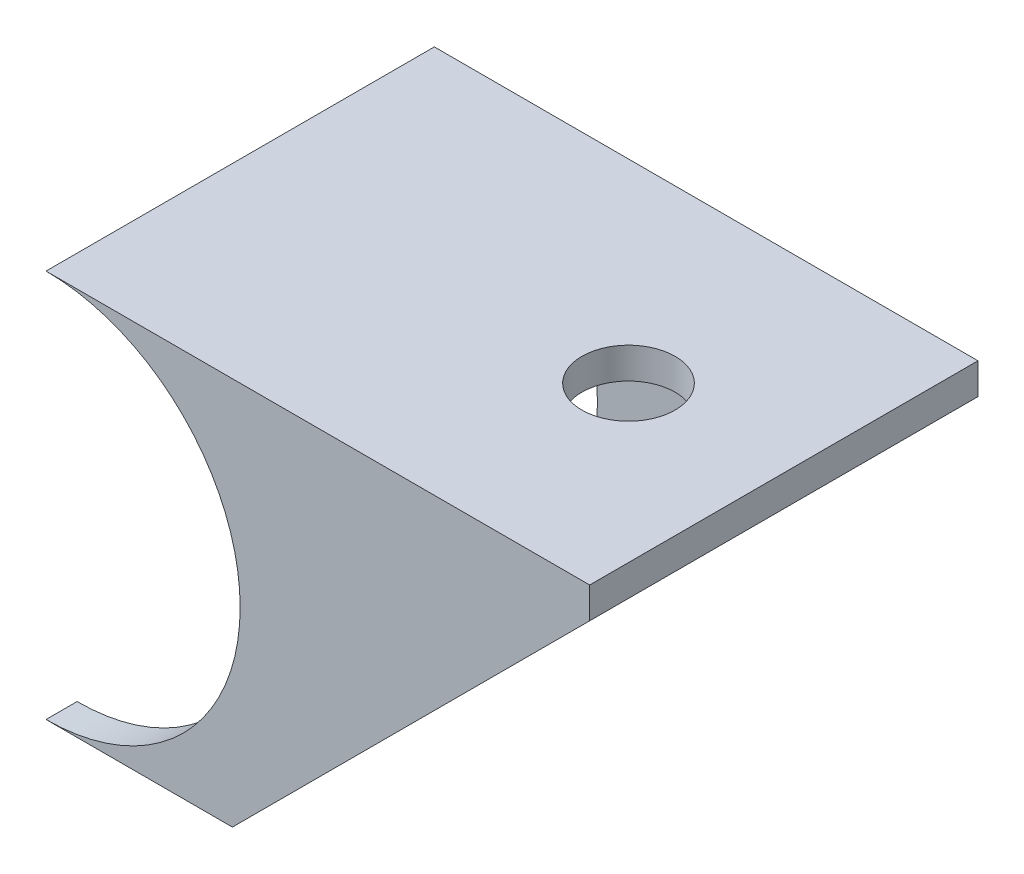
ISO-10303-21;
HEADER;
FILE_DESCRIPTION(('STEP AP214'),'2;1');
FILE_NAME('part.step','',(''),(''),'','','');
FILE_SCHEMA(('AUTOMOTIVE_DESIGN { 1 0 10303 214 1 1 1 1 }'));
ENDSEC;
DATA;
#1=APPLICATION_CONTEXT('core data for automotive mechanical design processes');
#2=APPLICATION_PROTOCOL_DEFINITION('international standard','automotive_design',2000,#1);
#3=PRODUCT_CONTEXT('',#1,'mechanical');
#4=PRODUCT('Part','Part','',(#3));
#5=PRODUCT_RELATED_PRODUCT_CATEGORY('part','',(#4));
#6=PRODUCT_DEFINITION_FORMATION('','',#4);
#7=PRODUCT_DEFINITION_CONTEXT('part definition',#1,'design');
#8=PRODUCT_DEFINITION('design','',#6,#7);
#9=PRODUCT_DEFINITION_SHAPE('','',#8);
#10=(LENGTH_UNIT() NAMED_UNIT(*) SI_UNIT(.MILLI.,.METRE.));
#11=(NAMED_UNIT(*) PLANE_ANGLE_UNIT() SI_UNIT($,.RADIAN.));
#12=(NAMED_UNIT(*) SI_UNIT($,.STERADIAN.) SOLID_ANGLE_UNIT());
#13=UNCERTAINTY_MEASURE_WITH_UNIT(LENGTH_MEASURE(1.E-05),#10,'distance_accuracy_value','');
#14=(GEOMETRIC_REPRESENTATION_CONTEXT(3) GLOBAL_UNCERTAINTY_ASSIGNED_CONTEXT((#13)) GLOBAL_UNIT_ASSIGNED_CONTEXT((#10,
#11,#12)) REPRESENTATION_CONTEXT('',''));
#15=CARTESIAN_POINT('',(0.,0.,0.));
#16=DIRECTION('',(0.,0.,1.));
#17=DIRECTION('',(1.,0.,0.));
#18=AXIS2_PLACEMENT_3D('',#15,#16,#17);
#19=CARTESIAN_POINT('',(-15.,1.78571428571428,12.5));
#20=DIRECTION('',(0.,0.,-1.));
#21=DIRECTION('',(-1.,0.,0.));
#22=AXIS2_PLACEMENT_3D('',#19,#20,#21);
#23=CYLINDRICAL_SURFACE('',#22,12.5);
#24=CARTESIAN_POINT('',(-15.,1.78571428571428,-10.5));
#25=DIRECTION('',(0.,0.,1.));
#26=DIRECTION('',(1.,0.,0.));
#27=AXIS2_PLACEMENT_3D('',#24,#25,#26);
#28=CIRCLE('',#27,12.5);
#29=CARTESIAN_POINT('',(-8.21767001687475,12.2857142857143,-10.5));
#30=VERTEX_POINT('',#29);
#31=CARTESIAN_POINT('',(-15.,-10.7142857142857,-10.5));
#32=VERTEX_POINT('',#31);
#33=EDGE_CURVE('E166',#30,#32,#28,.F.);
#34=ORIENTED_EDGE('',*,*,#33,.F.);
#35=DIRECTION('',(0.,0.,-1.));
#36=VECTOR('',#35,1.);
#37=CARTESIAN_POINT('',(-8.21767001687475,12.2857142857143,0.));
#38=LINE('',#37,#36);
#39=CARTESIAN_POINT('',(-8.21767001687475,12.2857142857143,10.5));
#40=VERTEX_POINT('',#39);
#41=EDGE_CURVE('E182',#40,#30,#38,.T.);
#42=ORIENTED_EDGE('',*,*,#41,.F.);
#43=CARTESIAN_POINT('',(-15.,1.78571428571428,10.5));
#44=DIRECTION('',(0.,0.,1.));
#45=DIRECTION('',(1.,0.,0.));
#46=AXIS2_PLACEMENT_3D('',#43,#44,#45);
#47=CIRCLE('',#46,12.5);
#48=CARTESIAN_POINT('',(-15.,-10.7142857142857,10.5));
#49=VERTEX_POINT('',#48);
#50=EDGE_CURVE('E118',#40,#49,#47,.F.);
#51=ORIENTED_EDGE('',*,*,#50,.T.);
#52=DIRECTION('',(0.,0.,-1.));
#53=VECTOR('',#52,1.);
#54=CARTESIAN_POINT('',(-15.,-10.7142857142857,12.5));
#55=LINE('',#54,#53);
#56=CARTESIAN_POINT('',(-15.,-10.7142857142857,12.5));
#57=VERTEX_POINT('',#56);
#58=EDGE_CURVE('E113',#57,#49,#55,.T.);
#59=ORIENTED_EDGE('',*,*,#58,.F.);
#60=CARTESIAN_POINT('',(-15.,1.78571428571428,12.5));
#61=DIRECTION('',(0.,0.,-1.));
#62=DIRECTION('',(1.,0.,0.));
#63=AXIS2_PLACEMENT_3D('',#60,#61,#62);
#64=CIRCLE('',#63,12.5);
#65=CARTESIAN_POINT('',(-15.,14.2857142857143,12.5));
#66=VERTEX_POINT('',#65);
#67=EDGE_CURVE('E102',#66,#57,#64,.T.);
#68=ORIENTED_EDGE('',*,*,#67,.F.);
#69=DIRECTION('',(0.,0.,-1.));
#70=VECTOR('',#69,1.);
#71=CARTESIAN_POINT('',(-15.,14.2857142857143,12.5));
#72=LINE('',#71,#70);
#73=CARTESIAN_POINT('',(-15.,14.2857142857143,-12.5));
#74=VERTEX_POINT('',#73);
#75=EDGE_CURVE('E46',#66,#74,#72,.T.);
#76=ORIENTED_EDGE('',*,*,#75,.T.);
#77=CARTESIAN_POINT('',(-15.,1.78571428571428,-12.5));
#78=DIRECTION('',(0.,0.,-1.));
#79=DIRECTION('',(1.,0.,0.));
#80=AXIS2_PLACEMENT_3D('',#77,#78,#79);
#81=CIRCLE('',#80,12.5);
#82=CARTESIAN_POINT('',(-15.,-10.7142857142857,-12.5));
#83=VERTEX_POINT('',#82);
#84=EDGE_CURVE('E135',#74,#83,#81,.T.);
#85=ORIENTED_EDGE('',*,*,#84,.T.);
#86=EDGE_CURVE('E121',#32,#83,#55,.T.);
#87=ORIENTED_EDGE('',*,*,#86,.F.);
#88=EDGE_LOOP('',(#34,#42,#51,#59,#68,#76,#85,#87));
#89=FACE_BOUND('',#88,.T.);
#90=ADVANCED_FACE('F37',(#89),#23,.F.);
#91=CARTESIAN_POINT('',(-15.,-10.7142857142857,12.5));
#92=DIRECTION('',(0.,1.,0.));
#93=DIRECTION('',(-1.,0.,0.));
#94=AXIS2_PLACEMENT_3D('',#91,#92,#93);
#95=PLANE('',#94);
#96=DIRECTION('',(1.,0.,0.));
#97=VECTOR('',#96,1.);
#98=CARTESIAN_POINT('',(-15.,-10.7142857142857,-10.5));
#99=LINE('',#98,#97);
#100=CARTESIAN_POINT('',(-3.00000000000024,-10.7142857142857,-10.5));
#101=VERTEX_POINT('',#100);
#102=EDGE_CURVE('E163',#32,#101,#99,.T.);
#103=ORIENTED_EDGE('',*,*,#102,.F.);
#104=ORIENTED_EDGE('',*,*,#86,.T.);
#105=DIRECTION('',(1.,0.,0.));
#106=VECTOR('',#105,1.);
#107=CARTESIAN_POINT('',(-15.,-10.7142857142857,-12.5));
#108=LINE('',#107,#106);
#109=CARTESIAN_POINT('',(-3.00000000000024,-10.7142857142857,-12.5));
#110=VERTEX_POINT('',#109);
#111=EDGE_CURVE('E138',#83,#110,#108,.T.);
#112=ORIENTED_EDGE('',*,*,#111,.T.);
#113=DIRECTION('',(0.,0.,-1.));
#114=VECTOR('',#113,1.);
#115=CARTESIAN_POINT('',(-3.00000000000024,-10.7142857142857,12.5));
#116=LINE('',#115,#114);
#117=EDGE_CURVE('E147',#101,#110,#116,.T.);
#118=ORIENTED_EDGE('',*,*,#117,.F.);
#119=EDGE_LOOP('',(#103,#104,#112,#118));
#120=FACE_BOUND('',#119,.T.);
#121=ADVANCED_FACE('F159',(#120),#95,.F.);
#122=CARTESIAN_POINT('',(20.,12.2857142857143,12.5));
#123=DIRECTION('',(-0.707106781186544,0.707106781186551,0.));
#124=DIRECTION('',(-0.707106781186551,-0.707106781186544,0.));
#125=AXIS2_PLACEMENT_3D('',#122,#123,#124);
#126=PLANE('',#125);
#127=DIRECTION('',(0.707106781186551,0.707106781186544,0.));
#128=VECTOR('',#127,1.);
#129=CARTESIAN_POINT('',(20.,12.2857142857143,-10.5));
#130=LINE('',#129,#128);
#131=CARTESIAN_POINT('',(20.,12.2857142857143,-10.5));
#132=VERTEX_POINT('',#131);
#133=EDGE_CURVE('E184',#101,#132,#130,.T.);
#134=ORIENTED_EDGE('',*,*,#133,.F.);
#135=ORIENTED_EDGE('',*,*,#117,.T.);
#136=DIRECTION('',(0.707106781186551,0.707106781186544,0.));
#137=VECTOR('',#136,1.);
#138=CARTESIAN_POINT('',(20.,12.2857142857143,-12.5));
#139=LINE('',#138,#137);
#140=CARTESIAN_POINT('',(20.,12.2857142857143,-12.5));
#141=VERTEX_POINT('',#140);
#142=EDGE_CURVE('E141',#110,#141,#139,.T.);
#143=ORIENTED_EDGE('',*,*,#142,.T.);
#144=DIRECTION('',(0.,0.,-1.));
#145=VECTOR('',#144,1.);
#146=CARTESIAN_POINT('',(20.,12.2857142857143,12.5));
#147=LINE('',#146,#145);
#148=EDGE_CURVE('E87',#132,#141,#147,.T.);
#149=ORIENTED_EDGE('',*,*,#148,.F.);
#150=EDGE_LOOP('',(#134,#135,#143,#149));
#151=FACE_BOUND('',#150,.T.);
#152=ADVANCED_FACE('F209',(#151),#126,.F.);
#153=CARTESIAN_POINT('',(20.,12.2857142857143,12.5));
#154=DIRECTION('',(-1.,0.,0.));
#155=DIRECTION('',(0.,0.,1.));
#156=AXIS2_PLACEMENT_3D('',#153,#154,#155);
#157=PLANE('',#156);
#158=DIRECTION('',(0.,1.,0.));
#159=VECTOR('',#158,1.);
#160=CARTESIAN_POINT('',(20.,12.2857142857143,-12.5));
#161=LINE('',#160,#159);
#162=CARTESIAN_POINT('',(20.,14.2857142857143,-12.5));
#163=VERTEX_POINT('',#162);
#164=EDGE_CURVE('E130',#141,#163,#161,.T.);
#165=ORIENTED_EDGE('',*,*,#164,.T.);
#166=DIRECTION('',(0.,0.,-1.));
#167=VECTOR('',#166,1.);
#168=CARTESIAN_POINT('',(20.,14.2857142857143,12.5));
#169=LINE('',#168,#167);
#170=CARTESIAN_POINT('',(20.,14.2857142857143,12.5));
#171=VERTEX_POINT('',#170);
#172=EDGE_CURVE('E11',#171,#163,#169,.T.);
#173=ORIENTED_EDGE('',*,*,#172,.F.);
#174=DIRECTION('',(0.,1.,0.));
#175=VECTOR('',#174,1.);
#176=CARTESIAN_POINT('',(20.,12.2857142857143,12.5));
#177=LINE('',#176,#175);
#178=CARTESIAN_POINT('',(20.,12.2857142857143,12.5));
#179=VERTEX_POINT('',#178);
#180=EDGE_CURVE('E143',#179,#171,#177,.T.);
#181=ORIENTED_EDGE('',*,*,#180,.F.);
#182=CARTESIAN_POINT('',(20.,12.2857142857143,10.5));
#183=VERTEX_POINT('',#182);
#184=EDGE_CURVE('E144',#179,#183,#147,.T.);
#185=ORIENTED_EDGE('',*,*,#184,.T.);
#186=DIRECTION('',(0.,0.,-1.));
#187=VECTOR('',#186,1.);
#188=CARTESIAN_POINT('',(20.,12.2857142857143,12.5));
#189=LINE('',#188,#187);
#190=EDGE_CURVE('E133',#183,#132,#189,.T.);
#191=ORIENTED_EDGE('',*,*,#190,.T.);
#192=ORIENTED_EDGE('',*,*,#148,.T.);
#193=EDGE_LOOP('',(#165,#173,#181,#185,#191,#192));
#194=FACE_BOUND('',#193,.T.);
#195=ADVANCED_FACE('F39',(#194),#157,.F.);
#196=CARTESIAN_POINT('',(-15.,14.2857142857143,12.5));
#197=DIRECTION('',(0.,-1.,0.));
#198=DIRECTION('',(1.,0.,0.));
#199=AXIS2_PLACEMENT_3D('',#196,#197,#198);
#200=PLANE('',#199);
#201=CARTESIAN_POINT('',(9.99999999999999,14.2857142857143,0.));
#202=DIRECTION('',(0.,1.,0.));
#203=DIRECTION('',(-1.,0.,0.));
#204=AXIS2_PLACEMENT_3D('',#201,#202,#203);
#205=CIRCLE('',#204,3.);
#206=CARTESIAN_POINT('',(6.99999999999999,14.2857142857143,0.));
#207=VERTEX_POINT('',#206);
#208=EDGE_CURVE('E241',#207,#207,#205,.T.);
#209=ORIENTED_EDGE('',*,*,#208,.F.);
#210=EDGE_LOOP('',(#209));
#211=FACE_BOUND('',#210,.T.);
#212=DIRECTION('',(-1.,0.,0.));
#213=VECTOR('',#212,1.);
#214=CARTESIAN_POINT('',(-15.,14.2857142857143,-12.5));
#215=LINE('',#214,#213);
#216=EDGE_CURVE('E132',#163,#74,#215,.T.);
#217=ORIENTED_EDGE('',*,*,#216,.T.);
#218=ORIENTED_EDGE('',*,*,#75,.F.);
#219=DIRECTION('',(-1.,0.,0.));
#220=VECTOR('',#219,1.);
#221=CARTESIAN_POINT('',(-15.,14.2857142857143,12.5));
#222=LINE('',#221,#220);
#223=EDGE_CURVE('E95',#171,#66,#222,.T.);
#224=ORIENTED_EDGE('',*,*,#223,.F.);
#225=ORIENTED_EDGE('',*,*,#172,.T.);
#226=EDGE_LOOP('',(#217,#218,#224,#225));
#227=FACE_BOUND('',#226,.T.);
#228=ADVANCED_FACE('F200',(#211,#227),#200,.F.);
#229=ORIENTED_EDGE('',*,*,#58,.T.);
#230=DIRECTION('',(1.,0.,0.));
#231=VECTOR('',#230,1.);
#232=CARTESIAN_POINT('',(-15.,-10.7142857142857,10.5));
#233=LINE('',#232,#231);
#234=CARTESIAN_POINT('',(-3.00000000000024,-10.7142857142857,10.5));
#235=VERTEX_POINT('',#234);
#236=EDGE_CURVE('E178',#49,#235,#233,.T.);
#237=ORIENTED_EDGE('',*,*,#236,.T.);
#238=CARTESIAN_POINT('',(-3.00000000000024,-10.7142857142857,12.5));
#239=VERTEX_POINT('',#238);
#240=EDGE_CURVE('E125',#239,#235,#116,.T.);
#241=ORIENTED_EDGE('',*,*,#240,.F.);
#242=DIRECTION('',(1.,0.,0.));
#243=VECTOR('',#242,1.);
#244=CARTESIAN_POINT('',(-15.,-10.7142857142857,12.5));
#245=LINE('',#244,#243);
#246=EDGE_CURVE('E106',#57,#239,#245,.T.);
#247=ORIENTED_EDGE('',*,*,#246,.F.);
#248=EDGE_LOOP('',(#229,#237,#241,#247));
#249=FACE_BOUND('',#248,.T.);
#250=ADVANCED_FACE('F123',(#249),#95,.F.);
#251=ORIENTED_EDGE('',*,*,#240,.T.);
#252=DIRECTION('',(0.707106781186551,0.707106781186544,0.));
#253=VECTOR('',#252,1.);
#254=CARTESIAN_POINT('',(20.,12.2857142857143,10.5));
#255=LINE('',#254,#253);
#256=EDGE_CURVE('E188',#235,#183,#255,.T.);
#257=ORIENTED_EDGE('',*,*,#256,.T.);
#258=ORIENTED_EDGE('',*,*,#184,.F.);
#259=DIRECTION('',(0.707106781186551,0.707106781186544,0.));
#260=VECTOR('',#259,1.);
#261=CARTESIAN_POINT('',(20.,12.2857142857143,12.5));
#262=LINE('',#261,#260);
#263=EDGE_CURVE('E62',#239,#179,#262,.T.);
#264=ORIENTED_EDGE('',*,*,#263,.F.);
#265=EDGE_LOOP('',(#251,#257,#258,#264));
#266=FACE_BOUND('',#265,.T.);
#267=ADVANCED_FACE('F207',(#266),#126,.F.);
#268=CARTESIAN_POINT('',(-15.,1.78571428571428,12.5));
#269=DIRECTION('',(0.,0.,1.));
#270=DIRECTION('',(1.,0.,0.));
#271=AXIS2_PLACEMENT_3D('',#268,#269,#270);
#272=PLANE('',#271);
#273=ORIENTED_EDGE('',*,*,#180,.T.);
#274=ORIENTED_EDGE('',*,*,#223,.T.);
#275=ORIENTED_EDGE('',*,*,#67,.T.);
#276=ORIENTED_EDGE('',*,*,#246,.T.);
#277=ORIENTED_EDGE('',*,*,#263,.T.);
#278=EDGE_LOOP('',(#273,#274,#275,#276,#277));
#279=FACE_BOUND('',#278,.T.);
#280=ADVANCED_FACE('F104',(#279),#272,.T.);
#281=CARTESIAN_POINT('',(-15.,1.78571428571428,-12.5));
#282=DIRECTION('',(0.,0.,1.));
#283=DIRECTION('',(1.,0.,0.));
#284=AXIS2_PLACEMENT_3D('',#281,#282,#283);
#285=PLANE('',#284);
#286=ORIENTED_EDGE('',*,*,#164,.F.);
#287=ORIENTED_EDGE('',*,*,#142,.F.);
#288=ORIENTED_EDGE('',*,*,#111,.F.);
#289=ORIENTED_EDGE('',*,*,#84,.F.);
#290=ORIENTED_EDGE('',*,*,#216,.F.);
#291=EDGE_LOOP('',(#286,#287,#288,#289,#290));
#292=FACE_BOUND('',#291,.T.);
#293=ADVANCED_FACE('F154',(#292),#285,.F.);
#294=CARTESIAN_POINT('',(-15.,12.2857142857143,12.5));
#295=DIRECTION('',(0.,-1.,0.));
#296=DIRECTION('',(1.,0.,0.));
#297=AXIS2_PLACEMENT_3D('',#294,#295,#296);
#298=PLANE('',#297);
#299=CARTESIAN_POINT('',(9.99999999999999,12.2857142857143,0.));
#300=DIRECTION('',(0.,-1.,0.));
#301=DIRECTION('',(1.,0.,0.));
#302=AXIS2_PLACEMENT_3D('',#299,#300,#301);
#303=CIRCLE('',#302,3.);
#304=CARTESIAN_POINT('',(13.,12.2857142857143,0.));
#305=VERTEX_POINT('',#304);
#306=EDGE_CURVE('E41',#305,#305,#303,.T.);
#307=ORIENTED_EDGE('',*,*,#306,.F.);
#308=EDGE_LOOP('',(#307));
#309=FACE_BOUND('',#308,.T.);
#310=DIRECTION('',(-1.,0.,0.));
#311=VECTOR('',#310,1.);
#312=CARTESIAN_POINT('',(-15.,12.2857142857143,-10.5));
#313=LINE('',#312,#311);
#314=EDGE_CURVE('E53',#132,#30,#313,.T.);
#315=ORIENTED_EDGE('',*,*,#314,.F.);
#316=ORIENTED_EDGE('',*,*,#190,.F.);
#317=DIRECTION('',(-1.,0.,0.));
#318=VECTOR('',#317,1.);
#319=CARTESIAN_POINT('',(-15.,12.2857142857143,10.5));
#320=LINE('',#319,#318);
#321=EDGE_CURVE('E180',#183,#40,#320,.T.);
#322=ORIENTED_EDGE('',*,*,#321,.T.);
#323=ORIENTED_EDGE('',*,*,#41,.T.);
#324=EDGE_LOOP('',(#315,#316,#322,#323));
#325=FACE_BOUND('',#324,.T.);
#326=ADVANCED_FACE('F181',(#309,#325),#298,.T.);
#327=CARTESIAN_POINT('',(-15.,1.78571428571428,10.5));
#328=DIRECTION('',(0.,0.,1.));
#329=DIRECTION('',(1.,0.,0.));
#330=AXIS2_PLACEMENT_3D('',#327,#328,#329);
#331=PLANE('',#330);
#332=ORIENTED_EDGE('',*,*,#256,.F.);
#333=ORIENTED_EDGE('',*,*,#236,.F.);
#334=ORIENTED_EDGE('',*,*,#50,.F.);
#335=ORIENTED_EDGE('',*,*,#321,.F.);
#336=EDGE_LOOP('',(#332,#333,#334,#335));
#337=FACE_BOUND('',#336,.T.);
#338=ADVANCED_FACE('F186',(#337),#331,.F.);
#339=CARTESIAN_POINT('',(-15.,1.78571428571428,-10.5));
#340=DIRECTION('',(0.,0.,1.));
#341=DIRECTION('',(1.,0.,0.));
#342=AXIS2_PLACEMENT_3D('',#339,#340,#341);
#343=PLANE('',#342);
#344=ORIENTED_EDGE('',*,*,#314,.T.);
#345=ORIENTED_EDGE('',*,*,#33,.T.);
#346=ORIENTED_EDGE('',*,*,#102,.T.);
#347=ORIENTED_EDGE('',*,*,#133,.T.);
#348=EDGE_LOOP('',(#344,#345,#346,#347));
#349=FACE_BOUND('',#348,.T.);
#350=ADVANCED_FACE('F224',(#349),#343,.T.);
#351=CARTESIAN_POINT('',(9.99999999999999,-45.7142857142857,0.));
#352=DIRECTION('',(0.,1.,0.));
#353=DIRECTION('',(-1.,0.,0.));
#354=AXIS2_PLACEMENT_3D('',#351,#352,#353);
#355=CYLINDRICAL_SURFACE('',#354,3.);
#356=ORIENTED_EDGE('',*,*,#306,.T.);
#357=EDGE_LOOP('',(#356));
#358=FACE_BOUND('',#357,.T.);
#359=ORIENTED_EDGE('',*,*,#208,.T.);
#360=EDGE_LOOP('',(#359));
#361=FACE_BOUND('',#360,.T.);
#362=ADVANCED_FACE('F227',(#358,#361),#355,.F.);
#363=CLOSED_SHELL('',(#90,#121,#152,#195,#228,#250,#267,#280,#293,#326,#338,#350,#362));
#364=MANIFOLD_SOLID_BREP('B2',#363);
#365=ADVANCED_BREP_SHAPE_REPRESENTATION('',(#18,#364),#14);
#366=SHAPE_DEFINITION_REPRESENTATION(#9,#365);
ENDSEC;
END-ISO-10303-21;
